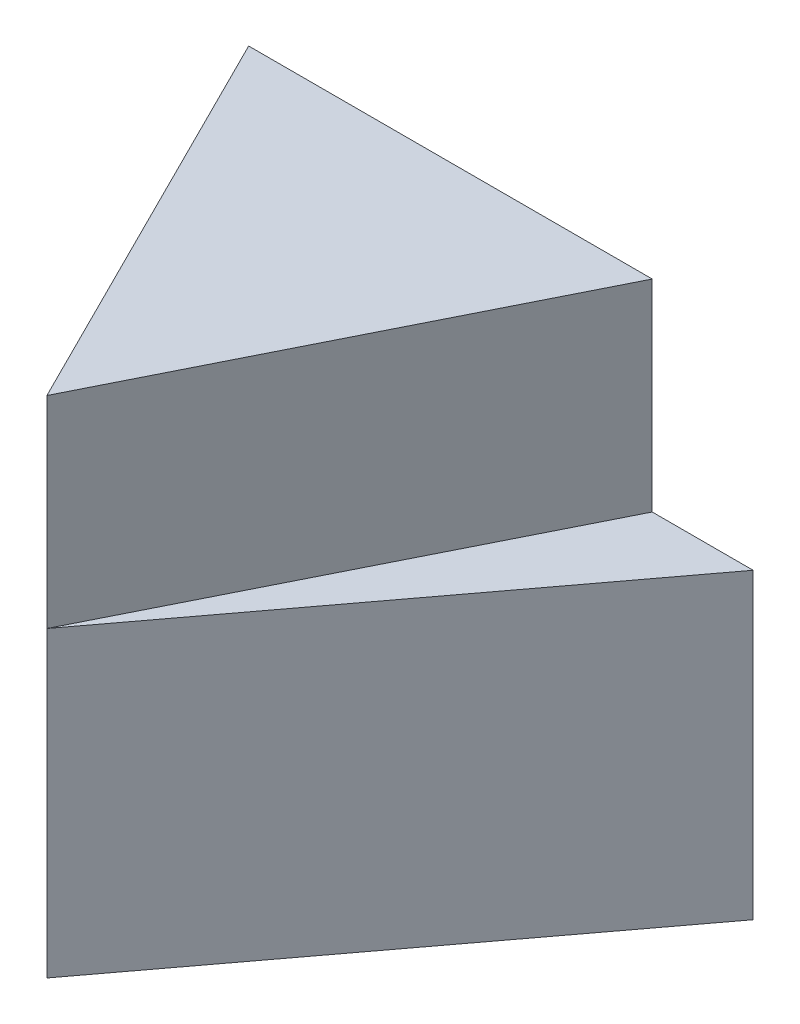
ISO-10303-21;
HEADER;
FILE_DESCRIPTION(('STEP AP214'),'2;1');
FILE_NAME('part.step','',(''),(''),'','','');
FILE_SCHEMA(('AUTOMOTIVE_DESIGN { 1 0 10303 214 1 1 1 1 }'));
ENDSEC;
DATA;
#1=APPLICATION_CONTEXT('core data for automotive mechanical design processes');
#2=APPLICATION_PROTOCOL_DEFINITION('international standard','automotive_design',2000,#1);
#3=PRODUCT_CONTEXT('',#1,'mechanical');
#4=PRODUCT('Part','Part','',(#3));
#5=PRODUCT_RELATED_PRODUCT_CATEGORY('part','',(#4));
#6=PRODUCT_DEFINITION_FORMATION('','',#4);
#7=PRODUCT_DEFINITION_CONTEXT('part definition',#1,'design');
#8=PRODUCT_DEFINITION('design','',#6,#7);
#9=PRODUCT_DEFINITION_SHAPE('','',#8);
#10=(LENGTH_UNIT() NAMED_UNIT(*) SI_UNIT(.MILLI.,.METRE.));
#11=(NAMED_UNIT(*) PLANE_ANGLE_UNIT() SI_UNIT($,.RADIAN.));
#12=(NAMED_UNIT(*) SI_UNIT($,.STERADIAN.) SOLID_ANGLE_UNIT());
#13=UNCERTAINTY_MEASURE_WITH_UNIT(LENGTH_MEASURE(1.E-05),#10,'distance_accuracy_value','');
#14=(GEOMETRIC_REPRESENTATION_CONTEXT(3) GLOBAL_UNCERTAINTY_ASSIGNED_CONTEXT((#13)) GLOBAL_UNIT_ASSIGNED_CONTEXT((#10,
#11,#12)) REPRESENTATION_CONTEXT('',''));
#15=CARTESIAN_POINT('',(0.,0.,0.));
#16=DIRECTION('',(0.,0.,1.));
#17=DIRECTION('',(1.,0.,0.));
#18=AXIS2_PLACEMENT_3D('',#15,#16,#17);
#19=CARTESIAN_POINT('',(0.,3.,0.));
#20=DIRECTION('',(0.,-1.,0.));
#21=DIRECTION('',(0.,0.,-1.));
#22=AXIS2_PLACEMENT_3D('',#19,#20,#21);
#23=PLANE('',#22);
#24=DIRECTION('',(0.447213595499958,0.,-0.894427190999916));
#25=VECTOR('',#24,1.);
#26=CARTESIAN_POINT('',(2.,3.,-4.));
#27=LINE('',#26,#25);
#28=CARTESIAN_POINT('',(0.,3.,0.));
#29=VERTEX_POINT('',#28);
#30=CARTESIAN_POINT('',(2.,3.,-4.));
#31=VERTEX_POINT('',#30);
#32=EDGE_CURVE('E37',#29,#31,#27,.T.);
#33=ORIENTED_EDGE('',*,*,#32,.F.);
#34=DIRECTION('',(0.6,0.,-0.8));
#35=VECTOR('',#34,1.);
#36=CARTESIAN_POINT('',(3.,3.,-4.));
#37=LINE('',#36,#35);
#38=CARTESIAN_POINT('',(3.,3.,-4.));
#39=VERTEX_POINT('',#38);
#40=EDGE_CURVE('E124',#29,#39,#37,.T.);
#41=ORIENTED_EDGE('',*,*,#40,.T.);
#42=DIRECTION('',(-1.,0.,0.));
#43=VECTOR('',#42,1.);
#44=CARTESIAN_POINT('',(-3.,3.,-4.));
#45=LINE('',#44,#43);
#46=EDGE_CURVE('E59',#39,#31,#45,.T.);
#47=ORIENTED_EDGE('',*,*,#46,.T.);
#48=EDGE_LOOP('',(#33,#41,#47));
#49=FACE_BOUND('',#48,.T.);
#50=ADVANCED_FACE('F33',(#49),#23,.F.);
#51=DIRECTION('',(0.447213595499958,0.,0.894427190999916));
#52=VECTOR('',#51,1.);
#53=CARTESIAN_POINT('',(0.,3.,0.));
#54=LINE('',#53,#52);
#55=CARTESIAN_POINT('',(-2.,3.,-4.));
#56=VERTEX_POINT('',#55);
#57=EDGE_CURVE('E51',#56,#29,#54,.T.);
#58=ORIENTED_EDGE('',*,*,#57,.F.);
#59=CARTESIAN_POINT('',(-3.,3.,-4.));
#60=VERTEX_POINT('',#59);
#61=EDGE_CURVE('E121',#56,#60,#45,.T.);
#62=ORIENTED_EDGE('',*,*,#61,.T.);
#63=DIRECTION('',(0.6,0.,0.8));
#64=VECTOR('',#63,1.);
#65=CARTESIAN_POINT('',(0.,3.,0.));
#66=LINE('',#65,#64);
#67=EDGE_CURVE('E129',#60,#29,#66,.T.);
#68=ORIENTED_EDGE('',*,*,#67,.T.);
#69=EDGE_LOOP('',(#58,#62,#68));
#70=FACE_BOUND('',#69,.T.);
#71=ADVANCED_FACE('F150',(#70),#23,.F.);
#72=CARTESIAN_POINT('',(3.,3.,-4.));
#73=DIRECTION('',(-0.8,0.,-0.6));
#74=DIRECTION('',(-0.6,0.,0.8));
#75=AXIS2_PLACEMENT_3D('',#72,#73,#74);
#76=PLANE('',#75);
#77=DIRECTION('',(0.6,0.,-0.8));
#78=VECTOR('',#77,1.);
#79=CARTESIAN_POINT('',(3.,0.,-4.));
#80=LINE('',#79,#78);
#81=CARTESIAN_POINT('',(0.,0.,0.));
#82=VERTEX_POINT('',#81);
#83=CARTESIAN_POINT('',(3.,0.,-4.));
#84=VERTEX_POINT('',#83);
#85=EDGE_CURVE('E107',#82,#84,#80,.T.);
#86=ORIENTED_EDGE('',*,*,#85,.T.);
#87=DIRECTION('',(0.,-1.,0.));
#88=VECTOR('',#87,1.);
#89=CARTESIAN_POINT('',(3.,3.,-4.));
#90=LINE('',#89,#88);
#91=EDGE_CURVE('E11',#39,#84,#90,.T.);
#92=ORIENTED_EDGE('',*,*,#91,.F.);
#93=ORIENTED_EDGE('',*,*,#40,.F.);
#94=DIRECTION('',(0.,-1.,0.));
#95=VECTOR('',#94,1.);
#96=CARTESIAN_POINT('',(0.,3.,0.));
#97=LINE('',#96,#95);
#98=EDGE_CURVE('E131',#29,#82,#97,.T.);
#99=ORIENTED_EDGE('',*,*,#98,.T.);
#100=EDGE_LOOP('',(#86,#92,#93,#99));
#101=FACE_BOUND('',#100,.T.);
#102=ADVANCED_FACE('F35',(#101),#76,.F.);
#103=CARTESIAN_POINT('',(-3.,3.,-4.));
#104=DIRECTION('',(0.,0.,1.));
#105=DIRECTION('',(1.,0.,0.));
#106=AXIS2_PLACEMENT_3D('',#103,#104,#105);
#107=PLANE('',#106);
#108=DIRECTION('',(-1.,0.,0.));
#109=VECTOR('',#108,1.);
#110=CARTESIAN_POINT('',(-3.,0.,-4.));
#111=LINE('',#110,#109);
#112=CARTESIAN_POINT('',(-3.,0.,-4.));
#113=VERTEX_POINT('',#112);
#114=EDGE_CURVE('E110',#84,#113,#111,.T.);
#115=ORIENTED_EDGE('',*,*,#114,.T.);
#116=DIRECTION('',(0.,-1.,0.));
#117=VECTOR('',#116,1.);
#118=CARTESIAN_POINT('',(-3.,3.,-4.));
#119=LINE('',#118,#117);
#120=EDGE_CURVE('E43',#60,#113,#119,.T.);
#121=ORIENTED_EDGE('',*,*,#120,.F.);
#122=ORIENTED_EDGE('',*,*,#61,.F.);
#123=DIRECTION('',(0.,-1.,0.));
#124=VECTOR('',#123,1.);
#125=CARTESIAN_POINT('',(-2.,5.,-4.));
#126=LINE('',#125,#124);
#127=CARTESIAN_POINT('',(-2.,5.,-4.));
#128=VERTEX_POINT('',#127);
#129=EDGE_CURVE('E94',#128,#56,#126,.T.);
#130=ORIENTED_EDGE('',*,*,#129,.F.);
#131=DIRECTION('',(-1.,0.,0.));
#132=VECTOR('',#131,1.);
#133=CARTESIAN_POINT('',(-2.,5.,-4.));
#134=LINE('',#133,#132);
#135=CARTESIAN_POINT('',(2.,5.,-4.));
#136=VERTEX_POINT('',#135);
#137=EDGE_CURVE('E87',#136,#128,#134,.T.);
#138=ORIENTED_EDGE('',*,*,#137,.F.);
#139=DIRECTION('',(0.,-1.,0.));
#140=VECTOR('',#139,1.);
#141=CARTESIAN_POINT('',(2.,5.,-4.));
#142=LINE('',#141,#140);
#143=EDGE_CURVE('E91',#136,#31,#142,.T.);
#144=ORIENTED_EDGE('',*,*,#143,.T.);
#145=ORIENTED_EDGE('',*,*,#46,.F.);
#146=ORIENTED_EDGE('',*,*,#91,.T.);
#147=EDGE_LOOP('',(#115,#121,#122,#130,#138,#144,#145,#146));
#148=FACE_BOUND('',#147,.T.);
#149=ADVANCED_FACE('F89',(#148),#107,.F.);
#150=CARTESIAN_POINT('',(0.,3.,0.));
#151=DIRECTION('',(0.8,0.,-0.6));
#152=DIRECTION('',(-0.6,0.,-0.8));
#153=AXIS2_PLACEMENT_3D('',#150,#151,#152);
#154=PLANE('',#153);
#155=DIRECTION('',(0.6,0.,0.8));
#156=VECTOR('',#155,1.);
#157=CARTESIAN_POINT('',(0.,0.,0.));
#158=LINE('',#157,#156);
#159=EDGE_CURVE('E134',#113,#82,#158,.T.);
#160=ORIENTED_EDGE('',*,*,#159,.T.);
#161=ORIENTED_EDGE('',*,*,#98,.F.);
#162=ORIENTED_EDGE('',*,*,#67,.F.);
#163=ORIENTED_EDGE('',*,*,#120,.T.);
#164=EDGE_LOOP('',(#160,#161,#162,#163));
#165=FACE_BOUND('',#164,.T.);
#166=ADVANCED_FACE('F143',(#165),#154,.F.);
#167=CARTESIAN_POINT('',(0.,0.,0.));
#168=DIRECTION('',(0.,-1.,0.));
#169=DIRECTION('',(0.,0.,-1.));
#170=AXIS2_PLACEMENT_3D('',#167,#168,#169);
#171=PLANE('',#170);
#172=ORIENTED_EDGE('',*,*,#85,.F.);
#173=ORIENTED_EDGE('',*,*,#159,.F.);
#174=ORIENTED_EDGE('',*,*,#114,.F.);
#175=EDGE_LOOP('',(#172,#173,#174));
#176=FACE_BOUND('',#175,.T.);
#177=ADVANCED_FACE('F147',(#176),#171,.T.);
#178=CARTESIAN_POINT('',(2.,5.,-4.));
#179=DIRECTION('',(-0.894427190999916,0.,-0.447213595499958));
#180=DIRECTION('',(-0.447213595499958,0.,0.894427190999916));
#181=AXIS2_PLACEMENT_3D('',#178,#179,#180);
#182=PLANE('',#181);
#183=ORIENTED_EDGE('',*,*,#32,.T.);
#184=ORIENTED_EDGE('',*,*,#143,.F.);
#185=DIRECTION('',(0.447213595499958,0.,-0.894427190999916));
#186=VECTOR('',#185,1.);
#187=CARTESIAN_POINT('',(2.,5.,-4.));
#188=LINE('',#187,#186);
#189=CARTESIAN_POINT('',(0.,5.,0.));
#190=VERTEX_POINT('',#189);
#191=EDGE_CURVE('E98',#190,#136,#188,.T.);
#192=ORIENTED_EDGE('',*,*,#191,.F.);
#193=DIRECTION('',(0.,-1.,0.));
#194=VECTOR('',#193,1.);
#195=CARTESIAN_POINT('',(0.,5.,0.));
#196=LINE('',#195,#194);
#197=EDGE_CURVE('E112',#190,#29,#196,.T.);
#198=ORIENTED_EDGE('',*,*,#197,.T.);
#199=EDGE_LOOP('',(#183,#184,#192,#198));
#200=FACE_BOUND('',#199,.T.);
#201=ADVANCED_FACE('F106',(#200),#182,.F.);
#202=CARTESIAN_POINT('',(0.,5.,0.));
#203=DIRECTION('',(0.894427190999916,0.,-0.447213595499958));
#204=DIRECTION('',(-0.447213595499958,0.,-0.894427190999916));
#205=AXIS2_PLACEMENT_3D('',#202,#203,#204);
#206=PLANE('',#205);
#207=ORIENTED_EDGE('',*,*,#57,.T.);
#208=ORIENTED_EDGE('',*,*,#197,.F.);
#209=DIRECTION('',(0.447213595499958,0.,0.894427190999916));
#210=VECTOR('',#209,1.);
#211=CARTESIAN_POINT('',(0.,5.,0.));
#212=LINE('',#211,#210);
#213=EDGE_CURVE('E97',#128,#190,#212,.T.);
#214=ORIENTED_EDGE('',*,*,#213,.F.);
#215=ORIENTED_EDGE('',*,*,#129,.T.);
#216=EDGE_LOOP('',(#207,#208,#214,#215));
#217=FACE_BOUND('',#216,.T.);
#218=ADVANCED_FACE('F152',(#217),#206,.F.);
#219=CARTESIAN_POINT('',(0.,5.,0.));
#220=DIRECTION('',(0.,1.,0.));
#221=DIRECTION('',(0.,0.,1.));
#222=AXIS2_PLACEMENT_3D('',#219,#220,#221);
#223=PLANE('',#222);
#224=ORIENTED_EDGE('',*,*,#191,.T.);
#225=ORIENTED_EDGE('',*,*,#137,.T.);
#226=ORIENTED_EDGE('',*,*,#213,.T.);
#227=EDGE_LOOP('',(#224,#225,#226));
#228=FACE_BOUND('',#227,.T.);
#229=ADVANCED_FACE('F101',(#228),#223,.T.);
#230=CLOSED_SHELL('',(#50,#71,#102,#149,#166,#177,#201,#218,#229));
#231=MANIFOLD_SOLID_BREP('B2',#230);
#232=ADVANCED_BREP_SHAPE_REPRESENTATION('',(#18,#231),#14);
#233=SHAPE_DEFINITION_REPRESENTATION(#9,#232);
ENDSEC;
END-ISO-10303-21;
